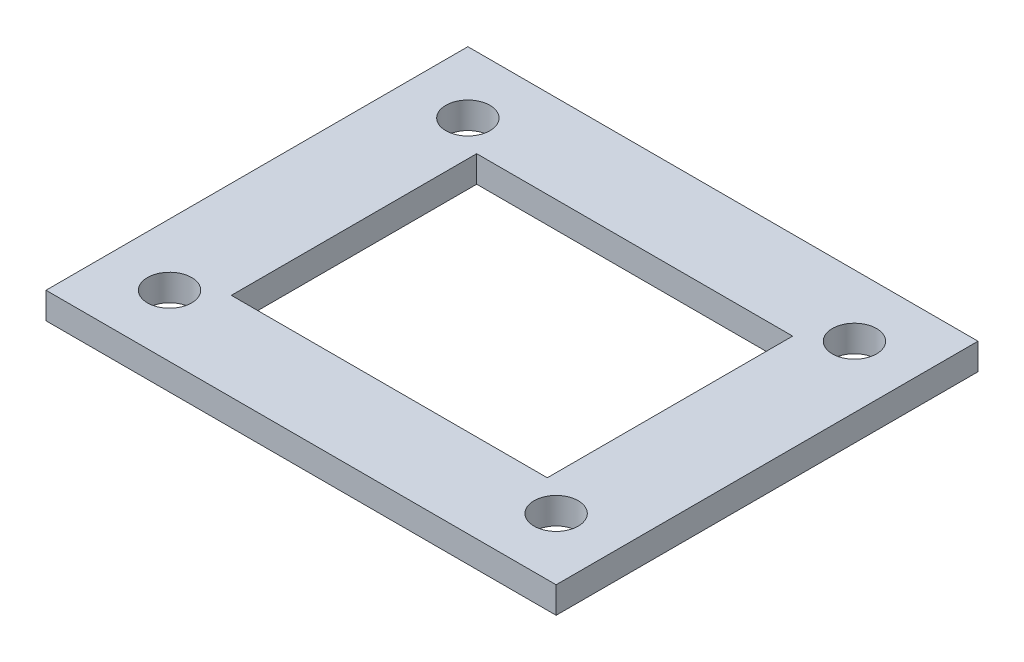
ISO-10303-21;
HEADER;
FILE_DESCRIPTION(('STEP AP214'),'2;1');
FILE_NAME('part.step','',(''),(''),'','','');
FILE_SCHEMA(('AUTOMOTIVE_DESIGN { 1 0 10303 214 1 1 1 1 }'));
ENDSEC;
DATA;
#1=APPLICATION_CONTEXT('core data for automotive mechanical design processes');
#2=APPLICATION_PROTOCOL_DEFINITION('international standard','automotive_design',2000,#1);
#3=PRODUCT_CONTEXT('',#1,'mechanical');
#4=PRODUCT('Part','Part','',(#3));
#5=PRODUCT_RELATED_PRODUCT_CATEGORY('part','',(#4));
#6=PRODUCT_DEFINITION_FORMATION('','',#4);
#7=PRODUCT_DEFINITION_CONTEXT('part definition',#1,'design');
#8=PRODUCT_DEFINITION('design','',#6,#7);
#9=PRODUCT_DEFINITION_SHAPE('','',#8);
#10=(LENGTH_UNIT() NAMED_UNIT(*) SI_UNIT(.MILLI.,.METRE.));
#11=(NAMED_UNIT(*) PLANE_ANGLE_UNIT() SI_UNIT($,.RADIAN.));
#12=(NAMED_UNIT(*) SI_UNIT($,.STERADIAN.) SOLID_ANGLE_UNIT());
#13=UNCERTAINTY_MEASURE_WITH_UNIT(LENGTH_MEASURE(1.E-05),#10,'distance_accuracy_value','');
#14=(GEOMETRIC_REPRESENTATION_CONTEXT(3) GLOBAL_UNCERTAINTY_ASSIGNED_CONTEXT((#13)) GLOBAL_UNIT_ASSIGNED_CONTEXT((#10,
#11,#12)) REPRESENTATION_CONTEXT('',''));
#15=CARTESIAN_POINT('',(0.,0.,0.));
#16=DIRECTION('',(0.,0.,1.));
#17=DIRECTION('',(1.,0.,0.));
#18=AXIS2_PLACEMENT_3D('',#15,#16,#17);
#19=CARTESIAN_POINT('',(0.,3.,0.));
#20=DIRECTION('',(0.,-1.,0.));
#21=DIRECTION('',(0.,0.,-1.));
#22=AXIS2_PLACEMENT_3D('',#19,#20,#21);
#23=PLANE('',#22);
#24=DIRECTION('',(-1.,0.,0.));
#25=VECTOR('',#24,1.);
#26=CARTESIAN_POINT('',(-17.9,3.,-13.9));
#27=LINE('',#26,#25);
#28=CARTESIAN_POINT('',(17.9,3.,-13.9));
#29=VERTEX_POINT('',#28);
#30=CARTESIAN_POINT('',(-17.9,3.,-13.9));
#31=VERTEX_POINT('',#30);
#32=EDGE_CURVE('E149',#29,#31,#27,.T.);
#33=ORIENTED_EDGE('',*,*,#32,.F.);
#34=DIRECTION('',(0.,0.,-1.));
#35=VECTOR('',#34,1.);
#36=CARTESIAN_POINT('',(17.9,3.,13.9));
#37=LINE('',#36,#35);
#38=CARTESIAN_POINT('',(17.9,3.,13.9));
#39=VERTEX_POINT('',#38);
#40=EDGE_CURVE('E52',#39,#29,#37,.T.);
#41=ORIENTED_EDGE('',*,*,#40,.F.);
#42=DIRECTION('',(1.,0.,0.));
#43=VECTOR('',#42,1.);
#44=CARTESIAN_POINT('',(-17.9,3.,13.9));
#45=LINE('',#44,#43);
#46=CARTESIAN_POINT('',(-17.9,3.,13.9));
#47=VERTEX_POINT('',#46);
#48=EDGE_CURVE('E140',#47,#39,#45,.T.);
#49=ORIENTED_EDGE('',*,*,#48,.F.);
#50=DIRECTION('',(0.,0.,1.));
#51=VECTOR('',#50,1.);
#52=CARTESIAN_POINT('',(-17.9,3.,13.9));
#53=LINE('',#52,#51);
#54=EDGE_CURVE('E153',#31,#47,#53,.T.);
#55=ORIENTED_EDGE('',*,*,#54,.F.);
#56=EDGE_LOOP('',(#33,#41,#49,#55));
#57=FACE_BOUND('',#56,.T.);
#58=CARTESIAN_POINT('',(21.9,3.,16.9));
#59=DIRECTION('',(0.,1.,0.));
#60=DIRECTION('',(0.,0.,-1.));
#61=AXIS2_PLACEMENT_3D('',#58,#59,#60);
#62=CIRCLE('',#61,2.5);
#63=CARTESIAN_POINT('',(21.9,3.,14.4));
#64=VERTEX_POINT('',#63);
#65=EDGE_CURVE('E160',#64,#64,#62,.T.);
#66=ORIENTED_EDGE('',*,*,#65,.F.);
#67=EDGE_LOOP('',(#66));
#68=FACE_BOUND('',#67,.T.);
#69=CARTESIAN_POINT('',(21.9,3.,-16.9));
#70=DIRECTION('',(0.,-1.,0.));
#71=DIRECTION('',(0.,0.,1.));
#72=AXIS2_PLACEMENT_3D('',#69,#70,#71);
#73=CIRCLE('',#72,2.5);
#74=CARTESIAN_POINT('',(21.9,3.,-14.4));
#75=VERTEX_POINT('',#74);
#76=EDGE_CURVE('E169',#75,#75,#73,.T.);
#77=ORIENTED_EDGE('',*,*,#76,.T.);
#78=EDGE_LOOP('',(#77));
#79=FACE_BOUND('',#78,.T.);
#80=CARTESIAN_POINT('',(-21.9,3.,16.9));
#81=DIRECTION('',(0.,-1.,0.));
#82=DIRECTION('',(0.,0.,-1.));
#83=AXIS2_PLACEMENT_3D('',#80,#81,#82);
#84=CIRCLE('',#83,2.5);
#85=CARTESIAN_POINT('',(-21.9,3.,14.4));
#86=VERTEX_POINT('',#85);
#87=EDGE_CURVE('E175',#86,#86,#84,.T.);
#88=ORIENTED_EDGE('',*,*,#87,.T.);
#89=EDGE_LOOP('',(#88));
#90=FACE_BOUND('',#89,.T.);
#91=CARTESIAN_POINT('',(-21.9,3.,-16.9));
#92=DIRECTION('',(0.,1.,0.));
#93=DIRECTION('',(0.,0.,1.));
#94=AXIS2_PLACEMENT_3D('',#91,#92,#93);
#95=CIRCLE('',#94,2.5);
#96=CARTESIAN_POINT('',(-21.9,3.,-14.4));
#97=VERTEX_POINT('',#96);
#98=EDGE_CURVE('E41',#97,#97,#95,.T.);
#99=ORIENTED_EDGE('',*,*,#98,.F.);
#100=EDGE_LOOP('',(#99));
#101=FACE_BOUND('',#100,.T.);
#102=DIRECTION('',(1.,0.,0.));
#103=VECTOR('',#102,1.);
#104=CARTESIAN_POINT('',(-28.9,3.,23.9));
#105=LINE('',#104,#103);
#106=CARTESIAN_POINT('',(-28.9,3.,23.9));
#107=VERTEX_POINT('',#106);
#108=CARTESIAN_POINT('',(28.9,3.,23.9));
#109=VERTEX_POINT('',#108);
#110=EDGE_CURVE('E121',#107,#109,#105,.T.);
#111=ORIENTED_EDGE('',*,*,#110,.T.);
#112=DIRECTION('',(0.,0.,-1.));
#113=VECTOR('',#112,1.);
#114=CARTESIAN_POINT('',(28.9,3.,23.9));
#115=LINE('',#114,#113);
#116=CARTESIAN_POINT('',(28.9,3.,-23.9));
#117=VERTEX_POINT('',#116);
#118=EDGE_CURVE('E363',#109,#117,#115,.T.);
#119=ORIENTED_EDGE('',*,*,#118,.T.);
#120=DIRECTION('',(-1.,0.,0.));
#121=VECTOR('',#120,1.);
#122=CARTESIAN_POINT('',(28.9,3.,-23.9));
#123=LINE('',#122,#121);
#124=CARTESIAN_POINT('',(-28.9,3.,-23.9));
#125=VERTEX_POINT('',#124);
#126=EDGE_CURVE('E117',#117,#125,#123,.T.);
#127=ORIENTED_EDGE('',*,*,#126,.T.);
#128=DIRECTION('',(0.,0.,1.));
#129=VECTOR('',#128,1.);
#130=CARTESIAN_POINT('',(-28.9,3.,-23.9));
#131=LINE('',#130,#129);
#132=EDGE_CURVE('E150',#125,#107,#131,.T.);
#133=ORIENTED_EDGE('',*,*,#132,.T.);
#134=EDGE_LOOP('',(#111,#119,#127,#133));
#135=FACE_BOUND('',#134,.T.);
#136=ADVANCED_FACE('F37',(#57,#68,#79,#90,#101,#135),#23,.F.);
#137=CARTESIAN_POINT('',(0.,0.,0.));
#138=DIRECTION('',(0.,-1.,0.));
#139=DIRECTION('',(0.,0.,-1.));
#140=AXIS2_PLACEMENT_3D('',#137,#138,#139);
#141=PLANE('',#140);
#142=DIRECTION('',(0.,0.,-1.));
#143=VECTOR('',#142,1.);
#144=CARTESIAN_POINT('',(17.9,0.,13.9));
#145=LINE('',#144,#143);
#146=CARTESIAN_POINT('',(17.9,0.,13.9));
#147=VERTEX_POINT('',#146);
#148=CARTESIAN_POINT('',(17.9,0.,-13.9));
#149=VERTEX_POINT('',#148);
#150=EDGE_CURVE('E136',#147,#149,#145,.T.);
#151=ORIENTED_EDGE('',*,*,#150,.T.);
#152=DIRECTION('',(-1.,0.,0.));
#153=VECTOR('',#152,1.);
#154=CARTESIAN_POINT('',(-17.9,0.,-13.9));
#155=LINE('',#154,#153);
#156=CARTESIAN_POINT('',(-17.9,0.,-13.9));
#157=VERTEX_POINT('',#156);
#158=EDGE_CURVE('E139',#149,#157,#155,.T.);
#159=ORIENTED_EDGE('',*,*,#158,.T.);
#160=DIRECTION('',(0.,0.,1.));
#161=VECTOR('',#160,1.);
#162=CARTESIAN_POINT('',(-17.9,0.,13.9));
#163=LINE('',#162,#161);
#164=CARTESIAN_POINT('',(-17.9,0.,13.9));
#165=VERTEX_POINT('',#164);
#166=EDGE_CURVE('E60',#157,#165,#163,.T.);
#167=ORIENTED_EDGE('',*,*,#166,.T.);
#168=DIRECTION('',(1.,0.,0.));
#169=VECTOR('',#168,1.);
#170=CARTESIAN_POINT('',(-17.9,0.,13.9));
#171=LINE('',#170,#169);
#172=EDGE_CURVE('E144',#165,#147,#171,.T.);
#173=ORIENTED_EDGE('',*,*,#172,.T.);
#174=EDGE_LOOP('',(#151,#159,#167,#173));
#175=FACE_BOUND('',#174,.T.);
#176=CARTESIAN_POINT('',(21.9,0.,16.9));
#177=DIRECTION('',(0.,1.,0.));
#178=DIRECTION('',(0.,0.,-1.));
#179=AXIS2_PLACEMENT_3D('',#176,#177,#178);
#180=CIRCLE('',#179,2.5);
#181=CARTESIAN_POINT('',(21.9,0.,14.4));
#182=VERTEX_POINT('',#181);
#183=EDGE_CURVE('E166',#182,#182,#180,.T.);
#184=ORIENTED_EDGE('',*,*,#183,.T.);
#185=EDGE_LOOP('',(#184));
#186=FACE_BOUND('',#185,.T.);
#187=CARTESIAN_POINT('',(21.9,0.,-16.9));
#188=DIRECTION('',(0.,-1.,0.));
#189=DIRECTION('',(0.,0.,1.));
#190=AXIS2_PLACEMENT_3D('',#187,#188,#189);
#191=CIRCLE('',#190,2.5);
#192=CARTESIAN_POINT('',(21.9,0.,-14.4));
#193=VERTEX_POINT('',#192);
#194=EDGE_CURVE('E172',#193,#193,#191,.T.);
#195=ORIENTED_EDGE('',*,*,#194,.F.);
#196=EDGE_LOOP('',(#195));
#197=FACE_BOUND('',#196,.T.);
#198=CARTESIAN_POINT('',(-21.9,0.,16.9));
#199=DIRECTION('',(0.,-1.,0.));
#200=DIRECTION('',(0.,0.,-1.));
#201=AXIS2_PLACEMENT_3D('',#198,#199,#200);
#202=CIRCLE('',#201,2.5);
#203=CARTESIAN_POINT('',(-21.9,0.,14.4));
#204=VERTEX_POINT('',#203);
#205=EDGE_CURVE('E178',#204,#204,#202,.T.);
#206=ORIENTED_EDGE('',*,*,#205,.F.);
#207=EDGE_LOOP('',(#206));
#208=FACE_BOUND('',#207,.T.);
#209=CARTESIAN_POINT('',(-21.9,0.,-16.9));
#210=DIRECTION('',(0.,1.,0.));
#211=DIRECTION('',(0.,0.,1.));
#212=AXIS2_PLACEMENT_3D('',#209,#210,#211);
#213=CIRCLE('',#212,2.5);
#214=CARTESIAN_POINT('',(-21.9,0.,-14.4));
#215=VERTEX_POINT('',#214);
#216=EDGE_CURVE('E11',#215,#215,#213,.T.);
#217=ORIENTED_EDGE('',*,*,#216,.T.);
#218=EDGE_LOOP('',(#217));
#219=FACE_BOUND('',#218,.T.);
#220=DIRECTION('',(1.,0.,0.));
#221=VECTOR('',#220,1.);
#222=CARTESIAN_POINT('',(-28.9,0.,23.9));
#223=LINE('',#222,#221);
#224=CARTESIAN_POINT('',(-28.9,0.,23.9));
#225=VERTEX_POINT('',#224);
#226=CARTESIAN_POINT('',(28.9,0.,23.9));
#227=VERTEX_POINT('',#226);
#228=EDGE_CURVE('E131',#225,#227,#223,.T.);
#229=ORIENTED_EDGE('',*,*,#228,.F.);
#230=DIRECTION('',(0.,0.,1.));
#231=VECTOR('',#230,1.);
#232=CARTESIAN_POINT('',(-28.9,0.,-23.9));
#233=LINE('',#232,#231);
#234=CARTESIAN_POINT('',(-28.9,0.,-23.9));
#235=VERTEX_POINT('',#234);
#236=EDGE_CURVE('E107',#235,#225,#233,.T.);
#237=ORIENTED_EDGE('',*,*,#236,.F.);
#238=DIRECTION('',(-1.,0.,0.));
#239=VECTOR('',#238,1.);
#240=CARTESIAN_POINT('',(28.9,0.,-23.9));
#241=LINE('',#240,#239);
#242=CARTESIAN_POINT('',(28.9,0.,-23.9));
#243=VERTEX_POINT('',#242);
#244=EDGE_CURVE('E101',#243,#235,#241,.T.);
#245=ORIENTED_EDGE('',*,*,#244,.F.);
#246=DIRECTION('',(0.,0.,-1.));
#247=VECTOR('',#246,1.);
#248=CARTESIAN_POINT('',(28.9,0.,23.9));
#249=LINE('',#248,#247);
#250=EDGE_CURVE('E104',#227,#243,#249,.T.);
#251=ORIENTED_EDGE('',*,*,#250,.F.);
#252=EDGE_LOOP('',(#229,#237,#245,#251));
#253=FACE_BOUND('',#252,.T.);
#254=ADVANCED_FACE('F39',(#175,#186,#197,#208,#219,#253),#141,.T.);
#255=CARTESIAN_POINT('',(-21.9,0.,-16.9));
#256=DIRECTION('',(0.,1.,0.));
#257=DIRECTION('',(0.,0.,1.));
#258=AXIS2_PLACEMENT_3D('',#255,#256,#257);
#259=CYLINDRICAL_SURFACE('',#258,2.5);
#260=ORIENTED_EDGE('',*,*,#216,.F.);
#261=EDGE_LOOP('',(#260));
#262=FACE_BOUND('',#261,.T.);
#263=ORIENTED_EDGE('',*,*,#98,.T.);
#264=EDGE_LOOP('',(#263));
#265=FACE_BOUND('',#264,.T.);
#266=ADVANCED_FACE('F189',(#262,#265),#259,.F.);
#267=CARTESIAN_POINT('',(-21.9,0.,16.9));
#268=DIRECTION('',(0.,1.,0.));
#269=DIRECTION('',(0.,0.,1.));
#270=AXIS2_PLACEMENT_3D('',#267,#268,#269);
#271=CYLINDRICAL_SURFACE('',#270,2.5);
#272=ORIENTED_EDGE('',*,*,#205,.T.);
#273=EDGE_LOOP('',(#272));
#274=FACE_BOUND('',#273,.T.);
#275=ORIENTED_EDGE('',*,*,#87,.F.);
#276=EDGE_LOOP('',(#275));
#277=FACE_BOUND('',#276,.T.);
#278=ADVANCED_FACE('F186',(#274,#277),#271,.F.);
#279=CARTESIAN_POINT('',(21.9,0.,-16.9));
#280=DIRECTION('',(0.,1.,0.));
#281=DIRECTION('',(0.,0.,1.));
#282=AXIS2_PLACEMENT_3D('',#279,#280,#281);
#283=CYLINDRICAL_SURFACE('',#282,2.5);
#284=ORIENTED_EDGE('',*,*,#194,.T.);
#285=EDGE_LOOP('',(#284));
#286=FACE_BOUND('',#285,.T.);
#287=ORIENTED_EDGE('',*,*,#76,.F.);
#288=EDGE_LOOP('',(#287));
#289=FACE_BOUND('',#288,.T.);
#290=ADVANCED_FACE('F188',(#286,#289),#283,.F.);
#291=CARTESIAN_POINT('',(21.9,0.,16.9));
#292=DIRECTION('',(0.,1.,0.));
#293=DIRECTION('',(0.,0.,1.));
#294=AXIS2_PLACEMENT_3D('',#291,#292,#293);
#295=CYLINDRICAL_SURFACE('',#294,2.5);
#296=ORIENTED_EDGE('',*,*,#183,.F.);
#297=EDGE_LOOP('',(#296));
#298=FACE_BOUND('',#297,.T.);
#299=ORIENTED_EDGE('',*,*,#65,.T.);
#300=EDGE_LOOP('',(#299));
#301=FACE_BOUND('',#300,.T.);
#302=ADVANCED_FACE('F196',(#298,#301),#295,.F.);
#303=CARTESIAN_POINT('',(17.9,0.,13.9));
#304=DIRECTION('',(1.,0.,0.));
#305=DIRECTION('',(0.,0.,-1.));
#306=AXIS2_PLACEMENT_3D('',#303,#304,#305);
#307=PLANE('',#306);
#308=ORIENTED_EDGE('',*,*,#40,.T.);
#309=DIRECTION('',(0.,1.,0.));
#310=VECTOR('',#309,1.);
#311=CARTESIAN_POINT('',(17.9,0.,-13.9));
#312=LINE('',#311,#310);
#313=EDGE_CURVE('E147',#149,#29,#312,.T.);
#314=ORIENTED_EDGE('',*,*,#313,.F.);
#315=ORIENTED_EDGE('',*,*,#150,.F.);
#316=DIRECTION('',(0.,1.,0.));
#317=VECTOR('',#316,1.);
#318=CARTESIAN_POINT('',(17.9,0.,13.9));
#319=LINE('',#318,#317);
#320=EDGE_CURVE('E158',#147,#39,#319,.T.);
#321=ORIENTED_EDGE('',*,*,#320,.T.);
#322=EDGE_LOOP('',(#308,#314,#315,#321));
#323=FACE_BOUND('',#322,.T.);
#324=ADVANCED_FACE('F216',(#323),#307,.F.);
#325=CARTESIAN_POINT('',(-17.9,0.,13.9));
#326=DIRECTION('',(0.,0.,1.));
#327=DIRECTION('',(1.,0.,0.));
#328=AXIS2_PLACEMENT_3D('',#325,#326,#327);
#329=PLANE('',#328);
#330=ORIENTED_EDGE('',*,*,#48,.T.);
#331=ORIENTED_EDGE('',*,*,#320,.F.);
#332=ORIENTED_EDGE('',*,*,#172,.F.);
#333=DIRECTION('',(0.,1.,0.));
#334=VECTOR('',#333,1.);
#335=CARTESIAN_POINT('',(-17.9,0.,13.9));
#336=LINE('',#335,#334);
#337=EDGE_CURVE('E161',#165,#47,#336,.T.);
#338=ORIENTED_EDGE('',*,*,#337,.T.);
#339=EDGE_LOOP('',(#330,#331,#332,#338));
#340=FACE_BOUND('',#339,.T.);
#341=ADVANCED_FACE('F222',(#340),#329,.F.);
#342=CARTESIAN_POINT('',(-17.9,0.,13.9));
#343=DIRECTION('',(-1.,0.,0.));
#344=DIRECTION('',(0.,0.,1.));
#345=AXIS2_PLACEMENT_3D('',#342,#343,#344);
#346=PLANE('',#345);
#347=ORIENTED_EDGE('',*,*,#54,.T.);
#348=ORIENTED_EDGE('',*,*,#337,.F.);
#349=ORIENTED_EDGE('',*,*,#166,.F.);
#350=DIRECTION('',(0.,1.,0.));
#351=VECTOR('',#350,1.);
#352=CARTESIAN_POINT('',(-17.9,0.,-13.9));
#353=LINE('',#352,#351);
#354=EDGE_CURVE('E163',#157,#31,#353,.T.);
#355=ORIENTED_EDGE('',*,*,#354,.T.);
#356=EDGE_LOOP('',(#347,#348,#349,#355));
#357=FACE_BOUND('',#356,.T.);
#358=ADVANCED_FACE('F230',(#357),#346,.F.);
#359=CARTESIAN_POINT('',(-17.9,0.,-13.9));
#360=DIRECTION('',(0.,0.,-1.));
#361=DIRECTION('',(-1.,0.,0.));
#362=AXIS2_PLACEMENT_3D('',#359,#360,#361);
#363=PLANE('',#362);
#364=ORIENTED_EDGE('',*,*,#32,.T.);
#365=ORIENTED_EDGE('',*,*,#354,.F.);
#366=ORIENTED_EDGE('',*,*,#158,.F.);
#367=ORIENTED_EDGE('',*,*,#313,.T.);
#368=EDGE_LOOP('',(#364,#365,#366,#367));
#369=FACE_BOUND('',#368,.T.);
#370=ADVANCED_FACE('F226',(#369),#363,.F.);
#371=CARTESIAN_POINT('',(-28.9,-75.0045331963342,23.9));
#372=DIRECTION('',(0.,0.,1.));
#373=DIRECTION('',(1.,0.,0.));
#374=AXIS2_PLACEMENT_3D('',#371,#372,#373);
#375=PLANE('',#374);
#376=DIRECTION('',(0.,1.,0.));
#377=VECTOR('',#376,1.);
#378=CARTESIAN_POINT('',(-28.9,-75.0045331963342,23.9));
#379=LINE('',#378,#377);
#380=EDGE_CURVE('E111',#225,#107,#379,.T.);
#381=ORIENTED_EDGE('',*,*,#380,.F.);
#382=ORIENTED_EDGE('',*,*,#228,.T.);
#383=DIRECTION('',(0.,1.,0.));
#384=VECTOR('',#383,1.);
#385=CARTESIAN_POINT('',(28.9,-75.0045331963342,23.9));
#386=LINE('',#385,#384);
#387=EDGE_CURVE('E125',#227,#109,#386,.T.);
#388=ORIENTED_EDGE('',*,*,#387,.T.);
#389=ORIENTED_EDGE('',*,*,#110,.F.);
#390=EDGE_LOOP('',(#381,#382,#388,#389));
#391=FACE_BOUND('',#390,.T.);
#392=ADVANCED_FACE('F229',(#391),#375,.T.);
#393=CARTESIAN_POINT('',(-28.9,-75.0045331963342,-23.9));
#394=DIRECTION('',(-1.,0.,0.));
#395=DIRECTION('',(0.,0.,1.));
#396=AXIS2_PLACEMENT_3D('',#393,#394,#395);
#397=PLANE('',#396);
#398=DIRECTION('',(0.,1.,0.));
#399=VECTOR('',#398,1.);
#400=CARTESIAN_POINT('',(-28.9,-75.0045331963342,-23.9));
#401=LINE('',#400,#399);
#402=EDGE_CURVE('E110',#235,#125,#401,.T.);
#403=ORIENTED_EDGE('',*,*,#402,.F.);
#404=ORIENTED_EDGE('',*,*,#236,.T.);
#405=ORIENTED_EDGE('',*,*,#380,.T.);
#406=ORIENTED_EDGE('',*,*,#132,.F.);
#407=EDGE_LOOP('',(#403,#404,#405,#406));
#408=FACE_BOUND('',#407,.T.);
#409=ADVANCED_FACE('F239',(#408),#397,.T.);
#410=CARTESIAN_POINT('',(28.9,-75.0045331963342,-23.9));
#411=DIRECTION('',(0.,0.,-1.));
#412=DIRECTION('',(-1.,0.,0.));
#413=AXIS2_PLACEMENT_3D('',#410,#411,#412);
#414=PLANE('',#413);
#415=DIRECTION('',(0.,1.,0.));
#416=VECTOR('',#415,1.);
#417=CARTESIAN_POINT('',(28.9,-75.0045331963342,-23.9));
#418=LINE('',#417,#416);
#419=EDGE_CURVE('E114',#243,#117,#418,.T.);
#420=ORIENTED_EDGE('',*,*,#419,.F.);
#421=ORIENTED_EDGE('',*,*,#244,.T.);
#422=ORIENTED_EDGE('',*,*,#402,.T.);
#423=ORIENTED_EDGE('',*,*,#126,.F.);
#424=EDGE_LOOP('',(#420,#421,#422,#423));
#425=FACE_BOUND('',#424,.T.);
#426=ADVANCED_FACE('F115',(#425),#414,.T.);
#427=CARTESIAN_POINT('',(28.9,-75.0045331963342,23.9));
#428=DIRECTION('',(1.,0.,0.));
#429=DIRECTION('',(0.,0.,-1.));
#430=AXIS2_PLACEMENT_3D('',#427,#428,#429);
#431=PLANE('',#430);
#432=ORIENTED_EDGE('',*,*,#387,.F.);
#433=ORIENTED_EDGE('',*,*,#250,.T.);
#434=ORIENTED_EDGE('',*,*,#419,.T.);
#435=ORIENTED_EDGE('',*,*,#118,.F.);
#436=EDGE_LOOP('',(#432,#433,#434,#435));
#437=FACE_BOUND('',#436,.T.);
#438=ADVANCED_FACE('F124',(#437),#431,.T.);
#439=CLOSED_SHELL('',(#136,#254,#266,#278,#290,#302,#324,#341,#358,#370,#392,#409,#426,#438));
#440=MANIFOLD_SOLID_BREP('B2',#439);
#441=ADVANCED_BREP_SHAPE_REPRESENTATION('',(#18,#440),#14);
#442=SHAPE_DEFINITION_REPRESENTATION(#9,#441);
ENDSEC;
END-ISO-10303-21;
